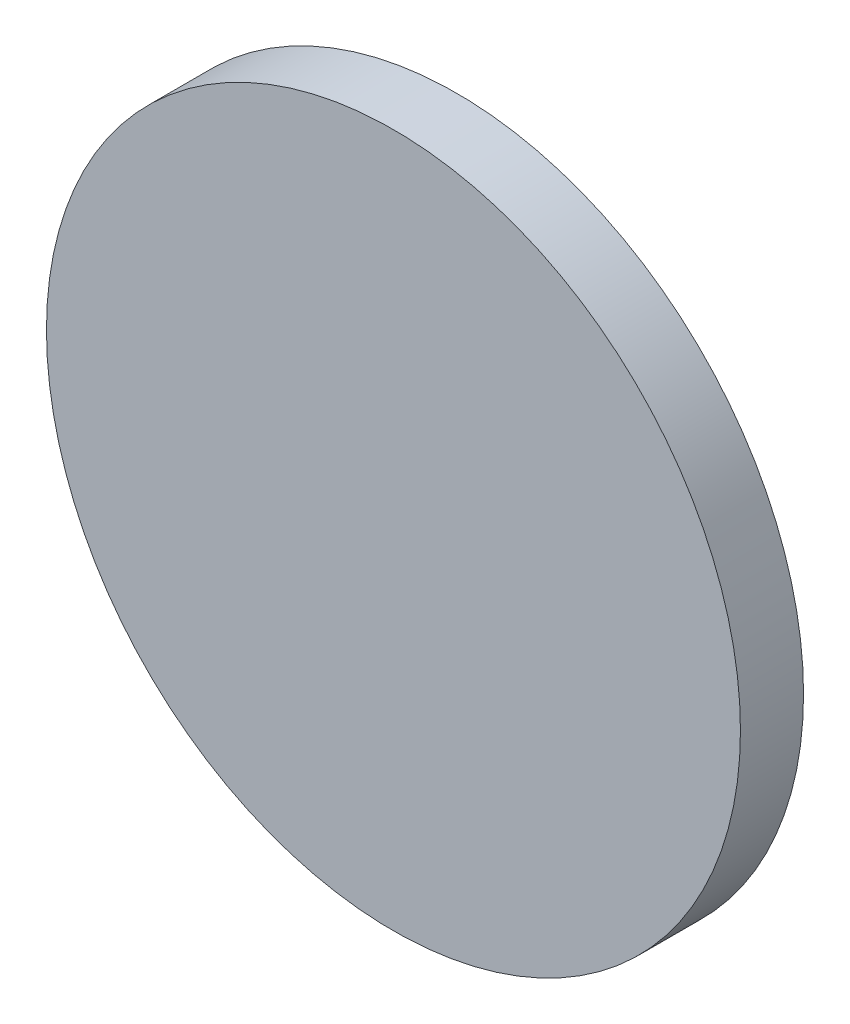
ISO-10303-21;
HEADER;
FILE_DESCRIPTION(('STEP AP214'),'2;1');
FILE_NAME('part.step','',(''),(''),'','','');
FILE_SCHEMA(('AUTOMOTIVE_DESIGN { 1 0 10303 214 1 1 1 1 }'));
ENDSEC;
DATA;
#1=APPLICATION_CONTEXT('core data for automotive mechanical design processes');
#2=APPLICATION_PROTOCOL_DEFINITION('international standard','automotive_design',2000,#1);
#3=PRODUCT_CONTEXT('',#1,'mechanical');
#4=PRODUCT('Part','Part','',(#3));
#5=PRODUCT_RELATED_PRODUCT_CATEGORY('part','',(#4));
#6=PRODUCT_DEFINITION_FORMATION('','',#4);
#7=PRODUCT_DEFINITION_CONTEXT('part definition',#1,'design');
#8=PRODUCT_DEFINITION('design','',#6,#7);
#9=PRODUCT_DEFINITION_SHAPE('','',#8);
#10=(LENGTH_UNIT() NAMED_UNIT(*) SI_UNIT(.MILLI.,.METRE.));
#11=(NAMED_UNIT(*) PLANE_ANGLE_UNIT() SI_UNIT($,.RADIAN.));
#12=(NAMED_UNIT(*) SI_UNIT($,.STERADIAN.) SOLID_ANGLE_UNIT());
#13=UNCERTAINTY_MEASURE_WITH_UNIT(LENGTH_MEASURE(1.E-05),#10,'distance_accuracy_value','');
#14=(GEOMETRIC_REPRESENTATION_CONTEXT(3) GLOBAL_UNCERTAINTY_ASSIGNED_CONTEXT((#13)) GLOBAL_UNIT_ASSIGNED_CONTEXT((#10,
#11,#12)) REPRESENTATION_CONTEXT('',''));
#15=CARTESIAN_POINT('',(0.,0.,0.));
#16=DIRECTION('',(0.,0.,1.));
#17=DIRECTION('',(1.,0.,0.));
#18=AXIS2_PLACEMENT_3D('',#15,#16,#17);
#19=CARTESIAN_POINT('',(0.,0.,2.));
#20=DIRECTION('',(0.,0.,-1.));
#21=DIRECTION('',(-1.,0.,0.));
#22=AXIS2_PLACEMENT_3D('',#19,#20,#21);
#23=CYLINDRICAL_SURFACE('',#22,11.);
#24=CARTESIAN_POINT('',(0.,0.,2.));
#25=DIRECTION('',(0.,0.,1.));
#26=DIRECTION('',(1.,0.,0.));
#27=AXIS2_PLACEMENT_3D('',#24,#25,#26);
#28=CIRCLE('',#27,11.);
#29=CARTESIAN_POINT('',(11.,0.,2.));
#30=VERTEX_POINT('',#29);
#31=EDGE_CURVE('E10',#30,#30,#28,.T.);
#32=ORIENTED_EDGE('',*,*,#31,.F.);
#33=EDGE_LOOP('',(#32));
#34=FACE_BOUND('',#33,.T.);
#35=CARTESIAN_POINT('',(0.,0.,0.));
#36=DIRECTION('',(0.,0.,1.));
#37=DIRECTION('',(1.,0.,0.));
#38=AXIS2_PLACEMENT_3D('',#35,#36,#37);
#39=CIRCLE('',#38,11.);
#40=CARTESIAN_POINT('',(11.,0.,0.));
#41=VERTEX_POINT('',#40);
#42=EDGE_CURVE('E34',#41,#41,#39,.T.);
#43=ORIENTED_EDGE('',*,*,#42,.T.);
#44=EDGE_LOOP('',(#43));
#45=FACE_BOUND('',#44,.T.);
#46=ADVANCED_FACE('F31',(#34,#45),#23,.T.);
#47=CARTESIAN_POINT('',(0.,0.,2.));
#48=DIRECTION('',(0.,0.,1.));
#49=DIRECTION('',(1.,0.,0.));
#50=AXIS2_PLACEMENT_3D('',#47,#48,#49);
#51=PLANE('',#50);
#52=ORIENTED_EDGE('',*,*,#31,.T.);
#53=EDGE_LOOP('',(#52));
#54=FACE_BOUND('',#53,.T.);
#55=ADVANCED_FACE('F46',(#54),#51,.T.);
#56=CARTESIAN_POINT('',(0.,0.,0.));
#57=DIRECTION('',(0.,0.,1.));
#58=DIRECTION('',(1.,0.,0.));
#59=AXIS2_PLACEMENT_3D('',#56,#57,#58);
#60=PLANE('',#59);
#61=ORIENTED_EDGE('',*,*,#42,.F.);
#62=EDGE_LOOP('',(#61));
#63=FACE_BOUND('',#62,.T.);
#64=ADVANCED_FACE('F44',(#63),#60,.F.);
#65=CLOSED_SHELL('',(#46,#55,#64));
#66=MANIFOLD_SOLID_BREP('B2',#65);
#67=ADVANCED_BREP_SHAPE_REPRESENTATION('',(#18,#66),#14);
#68=SHAPE_DEFINITION_REPRESENTATION(#9,#67);
ENDSEC;
END-ISO-10303-21;
